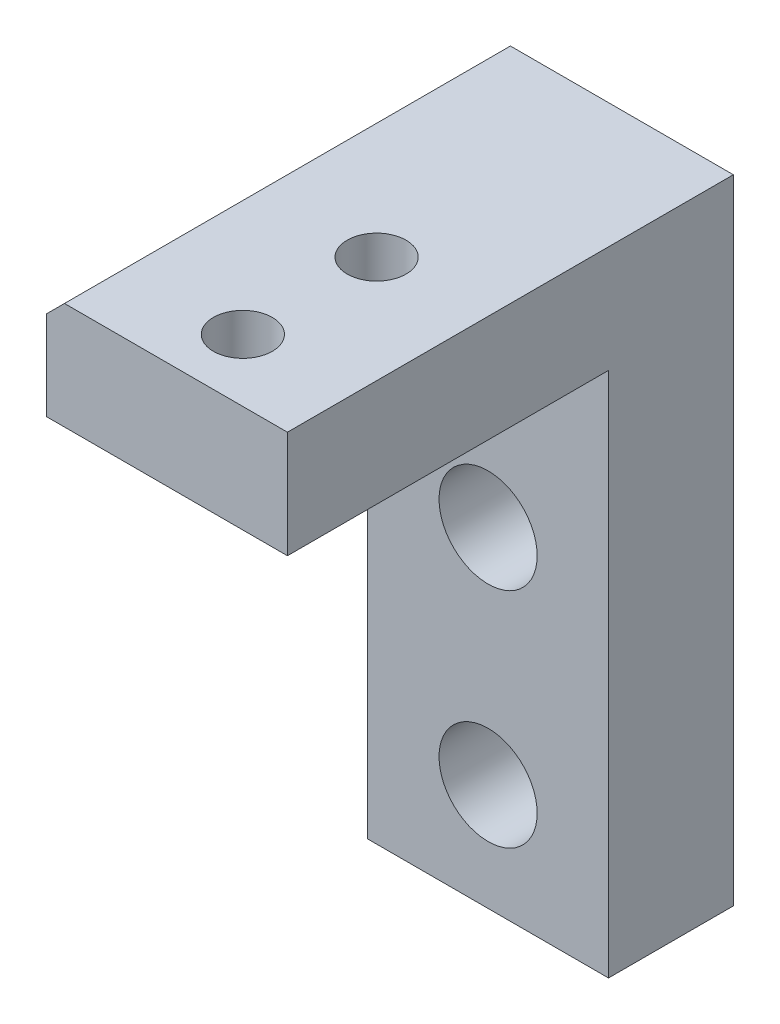
ISO-10303-21;
HEADER;
FILE_DESCRIPTION(('STEP AP214'),'2;1');
FILE_NAME('part.step','',(''),(''),'','','');
FILE_SCHEMA(('AUTOMOTIVE_DESIGN { 1 0 10303 214 1 1 1 1 }'));
ENDSEC;
DATA;
#1=APPLICATION_CONTEXT('core data for automotive mechanical design processes');
#2=APPLICATION_PROTOCOL_DEFINITION('international standard','automotive_design',2000,#1);
#3=PRODUCT_CONTEXT('',#1,'mechanical');
#4=PRODUCT('Part','Part','',(#3));
#5=PRODUCT_RELATED_PRODUCT_CATEGORY('part','',(#4));
#6=PRODUCT_DEFINITION_FORMATION('','',#4);
#7=PRODUCT_DEFINITION_CONTEXT('part definition',#1,'design');
#8=PRODUCT_DEFINITION('design','',#6,#7);
#9=PRODUCT_DEFINITION_SHAPE('','',#8);
#10=(LENGTH_UNIT() NAMED_UNIT(*) SI_UNIT(.MILLI.,.METRE.));
#11=(NAMED_UNIT(*) PLANE_ANGLE_UNIT() SI_UNIT($,.RADIAN.));
#12=(NAMED_UNIT(*) SI_UNIT($,.STERADIAN.) SOLID_ANGLE_UNIT());
#13=UNCERTAINTY_MEASURE_WITH_UNIT(LENGTH_MEASURE(1.E-05),#10,'distance_accuracy_value','');
#14=(GEOMETRIC_REPRESENTATION_CONTEXT(3) GLOBAL_UNCERTAINTY_ASSIGNED_CONTEXT((#13)) GLOBAL_UNIT_ASSIGNED_CONTEXT((#10,
#11,#12)) REPRESENTATION_CONTEXT('',''));
#15=CARTESIAN_POINT('',(0.,0.,0.));
#16=DIRECTION('',(0.,0.,1.));
#17=DIRECTION('',(1.,0.,0.));
#18=AXIS2_PLACEMENT_3D('',#15,#16,#17);
#19=CARTESIAN_POINT('',(0.,0.,7.));
#20=DIRECTION('',(0.,0.,1.));
#21=DIRECTION('',(1.,0.,0.));
#22=AXIS2_PLACEMENT_3D('',#19,#20,#21);
#23=PLANE('',#22);
#24=DIRECTION('',(1.,0.,0.));
#25=VECTOR('',#24,1.);
#26=CARTESIAN_POINT('',(-17.6696832579185,10.143665158371,7.));
#27=LINE('',#26,#25);
#28=CARTESIAN_POINT('',(-17.6696832579185,10.143665158371,7.));
#29=VERTEX_POINT('',#28);
#30=CARTESIAN_POINT('',(-4.16968325791852,10.143665158371,7.));
#31=VERTEX_POINT('',#30);
#32=EDGE_CURVE('E105',#29,#31,#27,.T.);
#33=ORIENTED_EDGE('',*,*,#32,.F.);
#34=DIRECTION('',(0.,-1.,0.));
#35=VECTOR('',#34,1.);
#36=CARTESIAN_POINT('',(-17.6696832579185,16.143665158371,7.));
#37=LINE('',#36,#35);
#38=CARTESIAN_POINT('',(-17.6696832579185,-19.356334841629,7.));
#39=VERTEX_POINT('',#38);
#40=EDGE_CURVE('E120',#29,#39,#37,.T.);
#41=ORIENTED_EDGE('',*,*,#40,.T.);
#42=DIRECTION('',(1.,0.,0.));
#43=VECTOR('',#42,1.);
#44=CARTESIAN_POINT('',(-17.6696832579185,-19.356334841629,7.));
#45=LINE('',#44,#43);
#46=CARTESIAN_POINT('',(-4.16968325791852,-19.356334841629,7.));
#47=VERTEX_POINT('',#46);
#48=EDGE_CURVE('E140',#39,#47,#45,.T.);
#49=ORIENTED_EDGE('',*,*,#48,.T.);
#50=DIRECTION('',(0.,1.,0.));
#51=VECTOR('',#50,1.);
#52=CARTESIAN_POINT('',(-4.16968325791853,16.143665158371,7.));
#53=LINE('',#52,#51);
#54=EDGE_CURVE('E143',#47,#31,#53,.T.);
#55=ORIENTED_EDGE('',*,*,#54,.T.);
#56=EDGE_LOOP('',(#33,#41,#49,#55));
#57=FACE_BOUND('',#56,.T.);
#58=CARTESIAN_POINT('',(-10.9196832579185,-13.356334841629,7.));
#59=DIRECTION('',(0.,0.,1.));
#60=DIRECTION('',(1.,0.,0.));
#61=AXIS2_PLACEMENT_3D('',#58,#59,#60);
#62=CIRCLE('',#61,2.75);
#63=CARTESIAN_POINT('',(-8.16968325791853,-13.356334841629,7.));
#64=VERTEX_POINT('',#63);
#65=EDGE_CURVE('E133',#64,#64,#62,.T.);
#66=ORIENTED_EDGE('',*,*,#65,.F.);
#67=EDGE_LOOP('',(#66));
#68=FACE_BOUND('',#67,.T.);
#69=CARTESIAN_POINT('',(-10.9196832579185,-0.856334841628959,7.));
#70=DIRECTION('',(0.,0.,1.));
#71=DIRECTION('',(1.,0.,0.));
#72=AXIS2_PLACEMENT_3D('',#69,#70,#71);
#73=CIRCLE('',#72,2.75);
#74=CARTESIAN_POINT('',(-8.16968325791853,-0.856334841628959,7.));
#75=VERTEX_POINT('',#74);
#76=EDGE_CURVE('E124',#75,#75,#73,.T.);
#77=ORIENTED_EDGE('',*,*,#76,.F.);
#78=EDGE_LOOP('',(#77));
#79=FACE_BOUND('',#78,.T.);
#80=ADVANCED_FACE('F35',(#57,#68,#79),#23,.T.);
#81=CARTESIAN_POINT('',(0.,0.,0.));
#82=DIRECTION('',(0.,0.,1.));
#83=DIRECTION('',(1.,0.,0.));
#84=AXIS2_PLACEMENT_3D('',#81,#82,#83);
#85=PLANE('',#84);
#86=DIRECTION('',(0.,-1.,0.));
#87=VECTOR('',#86,1.);
#88=CARTESIAN_POINT('',(-17.6696832579185,16.143665158371,0.));
#89=LINE('',#88,#87);
#90=CARTESIAN_POINT('',(-17.6696832579185,15.143665158371,0.));
#91=VERTEX_POINT('',#90);
#92=CARTESIAN_POINT('',(-17.6696832579185,-19.356334841629,0.));
#93=VERTEX_POINT('',#92);
#94=EDGE_CURVE('E136',#91,#93,#89,.T.);
#95=ORIENTED_EDGE('',*,*,#94,.F.);
#96=DIRECTION('',(-0.70710678118655,-0.707106781186545,0.));
#97=VECTOR('',#96,1.);
#98=CARTESIAN_POINT('',(-17.6696832579185,15.143665158371,0.));
#99=LINE('',#98,#97);
#100=CARTESIAN_POINT('',(-16.6696832579185,16.143665158371,0.));
#101=VERTEX_POINT('',#100);
#102=EDGE_CURVE('E58',#91,#101,#99,.F.);
#103=ORIENTED_EDGE('',*,*,#102,.T.);
#104=DIRECTION('',(-1.,0.,0.));
#105=VECTOR('',#104,1.);
#106=CARTESIAN_POINT('',(-17.6696832579185,16.143665158371,0.));
#107=LINE('',#106,#105);
#108=CARTESIAN_POINT('',(-4.16968325791853,16.143665158371,0.));
#109=VERTEX_POINT('',#108);
#110=EDGE_CURVE('E141',#109,#101,#107,.T.);
#111=ORIENTED_EDGE('',*,*,#110,.F.);
#112=DIRECTION('',(0.,1.,0.));
#113=VECTOR('',#112,1.);
#114=CARTESIAN_POINT('',(-4.16968325791853,16.143665158371,0.));
#115=LINE('',#114,#113);
#116=CARTESIAN_POINT('',(-4.16968325791852,-19.356334841629,0.));
#117=VERTEX_POINT('',#116);
#118=EDGE_CURVE('E149',#117,#109,#115,.T.);
#119=ORIENTED_EDGE('',*,*,#118,.F.);
#120=DIRECTION('',(1.,0.,0.));
#121=VECTOR('',#120,1.);
#122=CARTESIAN_POINT('',(-17.6696832579185,-19.356334841629,0.));
#123=LINE('',#122,#121);
#124=EDGE_CURVE('E147',#93,#117,#123,.T.);
#125=ORIENTED_EDGE('',*,*,#124,.F.);
#126=EDGE_LOOP('',(#95,#103,#111,#119,#125));
#127=FACE_BOUND('',#126,.T.);
#128=CARTESIAN_POINT('',(-10.9196832579185,-13.356334841629,0.));
#129=DIRECTION('',(0.,0.,1.));
#130=DIRECTION('',(1.,0.,0.));
#131=AXIS2_PLACEMENT_3D('',#128,#129,#130);
#132=CIRCLE('',#131,2.75);
#133=CARTESIAN_POINT('',(-8.16968325791853,-13.356334841629,0.));
#134=VERTEX_POINT('',#133);
#135=EDGE_CURVE('E131',#134,#134,#132,.T.);
#136=ORIENTED_EDGE('',*,*,#135,.T.);
#137=EDGE_LOOP('',(#136));
#138=FACE_BOUND('',#137,.T.);
#139=CARTESIAN_POINT('',(-10.9196832579185,-0.856334841628959,0.));
#140=DIRECTION('',(0.,0.,1.));
#141=DIRECTION('',(1.,0.,0.));
#142=AXIS2_PLACEMENT_3D('',#139,#140,#141);
#143=CIRCLE('',#142,2.75);
#144=CARTESIAN_POINT('',(-8.16968325791853,-0.856334841628959,0.));
#145=VERTEX_POINT('',#144);
#146=EDGE_CURVE('E121',#145,#145,#143,.T.);
#147=ORIENTED_EDGE('',*,*,#146,.T.);
#148=EDGE_LOOP('',(#147));
#149=FACE_BOUND('',#148,.T.);
#150=ADVANCED_FACE('F165',(#127,#138,#149),#85,.F.);
#151=CARTESIAN_POINT('',(-17.6696832579185,16.143665158371,7.));
#152=DIRECTION('',(1.,0.,0.));
#153=DIRECTION('',(0.,0.,-1.));
#154=AXIS2_PLACEMENT_3D('',#151,#152,#153);
#155=PLANE('',#154);
#156=DIRECTION('',(0.,-1.,0.));
#157=VECTOR('',#156,1.);
#158=CARTESIAN_POINT('',(-17.6696832579185,16.143665158371,25.));
#159=LINE('',#158,#157);
#160=CARTESIAN_POINT('',(-17.6696832579185,15.143665158371,25.));
#161=VERTEX_POINT('',#160);
#162=CARTESIAN_POINT('',(-17.6696832579185,10.143665158371,25.));
#163=VERTEX_POINT('',#162);
#164=EDGE_CURVE('E94',#161,#163,#159,.T.);
#165=ORIENTED_EDGE('',*,*,#164,.F.);
#166=DIRECTION('',(0.,0.,-1.));
#167=VECTOR('',#166,1.);
#168=CARTESIAN_POINT('',(-17.6696832579185,15.143665158371,7.));
#169=LINE('',#168,#167);
#170=EDGE_CURVE('E160',#161,#91,#169,.T.);
#171=ORIENTED_EDGE('',*,*,#170,.T.);
#172=ORIENTED_EDGE('',*,*,#94,.T.);
#173=DIRECTION('',(0.,0.,-1.));
#174=VECTOR('',#173,1.);
#175=CARTESIAN_POINT('',(-17.6696832579185,-19.356334841629,7.));
#176=LINE('',#175,#174);
#177=EDGE_CURVE('E157',#39,#93,#176,.T.);
#178=ORIENTED_EDGE('',*,*,#177,.F.);
#179=ORIENTED_EDGE('',*,*,#40,.F.);
#180=DIRECTION('',(0.,0.,-1.));
#181=VECTOR('',#180,1.);
#182=CARTESIAN_POINT('',(-17.6696832579185,10.143665158371,25.));
#183=LINE('',#182,#181);
#184=EDGE_CURVE('E111',#163,#29,#183,.T.);
#185=ORIENTED_EDGE('',*,*,#184,.F.);
#186=EDGE_LOOP('',(#165,#171,#172,#178,#179,#185));
#187=FACE_BOUND('',#186,.T.);
#188=ADVANCED_FACE('F118',(#187),#155,.F.);
#189=CARTESIAN_POINT('',(-17.6696832579185,-19.356334841629,7.));
#190=DIRECTION('',(0.,1.,0.));
#191=DIRECTION('',(0.,0.,1.));
#192=AXIS2_PLACEMENT_3D('',#189,#190,#191);
#193=PLANE('',#192);
#194=ORIENTED_EDGE('',*,*,#124,.T.);
#195=DIRECTION('',(0.,0.,-1.));
#196=VECTOR('',#195,1.);
#197=CARTESIAN_POINT('',(-4.16968325791852,-19.356334841629,7.));
#198=LINE('',#197,#196);
#199=EDGE_CURVE('E154',#47,#117,#198,.T.);
#200=ORIENTED_EDGE('',*,*,#199,.F.);
#201=ORIENTED_EDGE('',*,*,#48,.F.);
#202=ORIENTED_EDGE('',*,*,#177,.T.);
#203=EDGE_LOOP('',(#194,#200,#201,#202));
#204=FACE_BOUND('',#203,.T.);
#205=ADVANCED_FACE('F171',(#204),#193,.F.);
#206=CARTESIAN_POINT('',(-4.16968325791853,16.143665158371,7.));
#207=DIRECTION('',(-1.,0.,0.));
#208=DIRECTION('',(0.,-1.,0.));
#209=AXIS2_PLACEMENT_3D('',#206,#207,#208);
#210=PLANE('',#209);
#211=ORIENTED_EDGE('',*,*,#118,.T.);
#212=DIRECTION('',(0.,0.,-1.));
#213=VECTOR('',#212,1.);
#214=CARTESIAN_POINT('',(-4.16968325791853,16.143665158371,7.));
#215=LINE('',#214,#213);
#216=CARTESIAN_POINT('',(-4.16968325791853,16.143665158371,25.));
#217=VERTEX_POINT('',#216);
#218=EDGE_CURVE('E145',#217,#109,#215,.T.);
#219=ORIENTED_EDGE('',*,*,#218,.F.);
#220=DIRECTION('',(0.,1.,0.));
#221=VECTOR('',#220,1.);
#222=CARTESIAN_POINT('',(-4.16968325791853,16.143665158371,25.));
#223=LINE('',#222,#221);
#224=CARTESIAN_POINT('',(-4.16968325791852,10.143665158371,25.));
#225=VERTEX_POINT('',#224);
#226=EDGE_CURVE('E115',#225,#217,#223,.T.);
#227=ORIENTED_EDGE('',*,*,#226,.F.);
#228=DIRECTION('',(0.,0.,-1.));
#229=VECTOR('',#228,1.);
#230=CARTESIAN_POINT('',(-4.16968325791852,10.143665158371,25.));
#231=LINE('',#230,#229);
#232=EDGE_CURVE('E113',#225,#31,#231,.T.);
#233=ORIENTED_EDGE('',*,*,#232,.T.);
#234=ORIENTED_EDGE('',*,*,#54,.F.);
#235=ORIENTED_EDGE('',*,*,#199,.T.);
#236=EDGE_LOOP('',(#211,#219,#227,#233,#234,#235));
#237=FACE_BOUND('',#236,.T.);
#238=ADVANCED_FACE('F215',(#237),#210,.F.);
#239=CARTESIAN_POINT('',(-17.6696832579185,16.143665158371,7.));
#240=DIRECTION('',(0.,-1.,0.));
#241=DIRECTION('',(0.,0.,-1.));
#242=AXIS2_PLACEMENT_3D('',#239,#240,#241);
#243=PLANE('',#242);
#244=CARTESIAN_POINT('',(-10.1696832579185,16.143665158371,21.5));
#245=DIRECTION('',(0.,1.,0.));
#246=DIRECTION('',(0.,0.,1.));
#247=AXIS2_PLACEMENT_3D('',#244,#245,#246);
#248=CIRCLE('',#247,1.64999999999999);
#249=CARTESIAN_POINT('',(-10.1696832579185,16.143665158371,23.15));
#250=VERTEX_POINT('',#249);
#251=EDGE_CURVE('E184',#250,#250,#248,.T.);
#252=ORIENTED_EDGE('',*,*,#251,.F.);
#253=EDGE_LOOP('',(#252));
#254=FACE_BOUND('',#253,.T.);
#255=CARTESIAN_POINT('',(-10.1696832579185,16.143665158371,14.));
#256=DIRECTION('',(0.,1.,0.));
#257=DIRECTION('',(0.,0.,1.));
#258=AXIS2_PLACEMENT_3D('',#255,#256,#257);
#259=CIRCLE('',#258,1.64999999999999);
#260=CARTESIAN_POINT('',(-10.1696832579185,16.143665158371,15.65));
#261=VERTEX_POINT('',#260);
#262=EDGE_CURVE('E177',#261,#261,#259,.T.);
#263=ORIENTED_EDGE('',*,*,#262,.F.);
#264=EDGE_LOOP('',(#263));
#265=FACE_BOUND('',#264,.T.);
#266=ORIENTED_EDGE('',*,*,#110,.T.);
#267=DIRECTION('',(0.,0.,1.));
#268=VECTOR('',#267,1.);
#269=CARTESIAN_POINT('',(-16.6696832579185,16.143665158371,7.));
#270=LINE('',#269,#268);
#271=CARTESIAN_POINT('',(-16.6696832579185,16.143665158371,25.));
#272=VERTEX_POINT('',#271);
#273=EDGE_CURVE('E44',#101,#272,#270,.T.);
#274=ORIENTED_EDGE('',*,*,#273,.T.);
#275=DIRECTION('',(-1.,0.,0.));
#276=VECTOR('',#275,1.);
#277=CARTESIAN_POINT('',(-17.6696832579185,16.143665158371,25.));
#278=LINE('',#277,#276);
#279=EDGE_CURVE('E126',#217,#272,#278,.T.);
#280=ORIENTED_EDGE('',*,*,#279,.F.);
#281=ORIENTED_EDGE('',*,*,#218,.T.);
#282=EDGE_LOOP('',(#266,#274,#280,#281));
#283=FACE_BOUND('',#282,.T.);
#284=ADVANCED_FACE('F212',(#254,#265,#283),#243,.F.);
#285=CARTESIAN_POINT('',(-10.9196832579185,-13.356334841629,7.));
#286=DIRECTION('',(0.,0.,-1.));
#287=DIRECTION('',(-1.,0.,0.));
#288=AXIS2_PLACEMENT_3D('',#285,#286,#287);
#289=CYLINDRICAL_SURFACE('',#288,2.75);
#290=ORIENTED_EDGE('',*,*,#65,.T.);
#291=EDGE_LOOP('',(#290));
#292=FACE_BOUND('',#291,.T.);
#293=ORIENTED_EDGE('',*,*,#135,.F.);
#294=EDGE_LOOP('',(#293));
#295=FACE_BOUND('',#294,.T.);
#296=ADVANCED_FACE('F209',(#292,#295),#289,.F.);
#297=CARTESIAN_POINT('',(-10.9196832579185,-0.856334841628959,7.));
#298=DIRECTION('',(0.,0.,-1.));
#299=DIRECTION('',(-1.,0.,0.));
#300=AXIS2_PLACEMENT_3D('',#297,#298,#299);
#301=CYLINDRICAL_SURFACE('',#300,2.75);
#302=ORIENTED_EDGE('',*,*,#76,.T.);
#303=EDGE_LOOP('',(#302));
#304=FACE_BOUND('',#303,.T.);
#305=ORIENTED_EDGE('',*,*,#146,.F.);
#306=EDGE_LOOP('',(#305));
#307=FACE_BOUND('',#306,.T.);
#308=ADVANCED_FACE('F247',(#304,#307),#301,.F.);
#309=CARTESIAN_POINT('',(-17.6696832579185,10.143665158371,25.));
#310=DIRECTION('',(0.,1.,0.));
#311=DIRECTION('',(-1.,0.,0.));
#312=AXIS2_PLACEMENT_3D('',#309,#310,#311);
#313=PLANE('',#312);
#314=CARTESIAN_POINT('',(-10.1696832579185,10.143665158371,21.5));
#315=DIRECTION('',(0.,1.,0.));
#316=DIRECTION('',(-1.,0.,0.));
#317=AXIS2_PLACEMENT_3D('',#314,#315,#316);
#318=CIRCLE('',#317,1.64999999999999);
#319=CARTESIAN_POINT('',(-11.8196832579185,10.143665158371,21.5));
#320=VERTEX_POINT('',#319);
#321=EDGE_CURVE('E39',#320,#320,#318,.T.);
#322=ORIENTED_EDGE('',*,*,#321,.T.);
#323=EDGE_LOOP('',(#322));
#324=FACE_BOUND('',#323,.T.);
#325=CARTESIAN_POINT('',(-10.1696832579185,10.143665158371,14.));
#326=DIRECTION('',(0.,1.,0.));
#327=DIRECTION('',(-1.,0.,0.));
#328=AXIS2_PLACEMENT_3D('',#325,#326,#327);
#329=CIRCLE('',#328,1.64999999999999);
#330=CARTESIAN_POINT('',(-11.8196832579185,10.143665158371,14.));
#331=VERTEX_POINT('',#330);
#332=EDGE_CURVE('E175',#331,#331,#329,.T.);
#333=ORIENTED_EDGE('',*,*,#332,.T.);
#334=EDGE_LOOP('',(#333));
#335=FACE_BOUND('',#334,.T.);
#336=ORIENTED_EDGE('',*,*,#32,.T.);
#337=ORIENTED_EDGE('',*,*,#232,.F.);
#338=DIRECTION('',(1.,0.,0.));
#339=VECTOR('',#338,1.);
#340=CARTESIAN_POINT('',(-17.6696832579185,10.143665158371,25.));
#341=LINE('',#340,#339);
#342=EDGE_CURVE('E98',#163,#225,#341,.T.);
#343=ORIENTED_EDGE('',*,*,#342,.F.);
#344=ORIENTED_EDGE('',*,*,#184,.T.);
#345=EDGE_LOOP('',(#336,#337,#343,#344));
#346=FACE_BOUND('',#345,.T.);
#347=ADVANCED_FACE('F110',(#324,#335,#346),#313,.F.);
#348=CARTESIAN_POINT('',(0.,0.,25.));
#349=DIRECTION('',(0.,0.,1.));
#350=DIRECTION('',(1.,0.,0.));
#351=AXIS2_PLACEMENT_3D('',#348,#349,#350);
#352=PLANE('',#351);
#353=ORIENTED_EDGE('',*,*,#279,.T.);
#354=DIRECTION('',(0.70710678118655,0.707106781186545,0.));
#355=VECTOR('',#354,1.);
#356=CARTESIAN_POINT('',(-16.4066742081447,16.4066742081448,25.));
#357=LINE('',#356,#355);
#358=EDGE_CURVE('E11',#272,#161,#357,.F.);
#359=ORIENTED_EDGE('',*,*,#358,.T.);
#360=ORIENTED_EDGE('',*,*,#164,.T.);
#361=ORIENTED_EDGE('',*,*,#342,.T.);
#362=ORIENTED_EDGE('',*,*,#226,.T.);
#363=EDGE_LOOP('',(#353,#359,#360,#361,#362));
#364=FACE_BOUND('',#363,.T.);
#365=ADVANCED_FACE('F96',(#364),#352,.T.);
#366=CARTESIAN_POINT('',(-17.6696832579185,15.143665158371,7.));
#367=DIRECTION('',(0.707106781186545,-0.70710678118655,0.));
#368=DIRECTION('',(0.,0.,-1.));
#369=AXIS2_PLACEMENT_3D('',#366,#367,#368);
#370=PLANE('',#369);
#371=ORIENTED_EDGE('',*,*,#358,.F.);
#372=ORIENTED_EDGE('',*,*,#273,.F.);
#373=ORIENTED_EDGE('',*,*,#102,.F.);
#374=ORIENTED_EDGE('',*,*,#170,.F.);
#375=EDGE_LOOP('',(#371,#372,#373,#374));
#376=FACE_BOUND('',#375,.T.);
#377=ADVANCED_FACE('F37',(#376),#370,.F.);
#378=CARTESIAN_POINT('',(-10.1696832579185,16.143665158371,14.));
#379=DIRECTION('',(0.,1.,0.));
#380=DIRECTION('',(0.,0.,1.));
#381=AXIS2_PLACEMENT_3D('',#378,#379,#380);
#382=CYLINDRICAL_SURFACE('',#381,1.64999999999999);
#383=ORIENTED_EDGE('',*,*,#262,.T.);
#384=EDGE_LOOP('',(#383));
#385=FACE_BOUND('',#384,.T.);
#386=ORIENTED_EDGE('',*,*,#332,.F.);
#387=EDGE_LOOP('',(#386));
#388=FACE_BOUND('',#387,.T.);
#389=ADVANCED_FACE('F195',(#385,#388),#382,.F.);
#390=CARTESIAN_POINT('',(-10.1696832579185,16.143665158371,21.5));
#391=DIRECTION('',(0.,1.,0.));
#392=DIRECTION('',(0.,0.,1.));
#393=AXIS2_PLACEMENT_3D('',#390,#391,#392);
#394=CYLINDRICAL_SURFACE('',#393,1.64999999999999);
#395=ORIENTED_EDGE('',*,*,#251,.T.);
#396=EDGE_LOOP('',(#395));
#397=FACE_BOUND('',#396,.T.);
#398=ORIENTED_EDGE('',*,*,#321,.F.);
#399=EDGE_LOOP('',(#398));
#400=FACE_BOUND('',#399,.T.);
#401=ADVANCED_FACE('F193',(#397,#400),#394,.F.);
#402=CLOSED_SHELL('',(#80,#150,#188,#205,#238,#284,#296,#308,#347,#365,#377,#389,#401));
#403=MANIFOLD_SOLID_BREP('B2',#402);
#404=ADVANCED_BREP_SHAPE_REPRESENTATION('',(#18,#403),#14);
#405=SHAPE_DEFINITION_REPRESENTATION(#9,#404);
ENDSEC;
END-ISO-10303-21;
